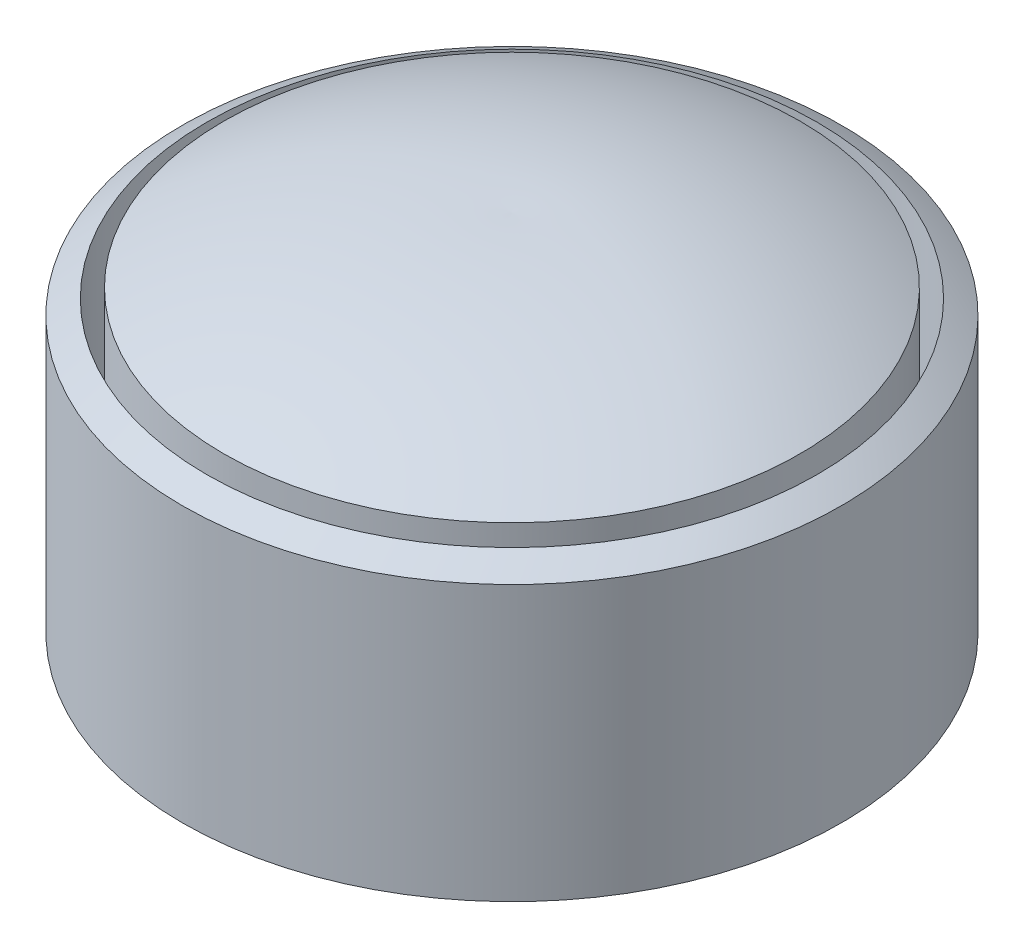
ISO-10303-21;
HEADER;
FILE_DESCRIPTION(('STEP AP214'),'2;1');
FILE_NAME('part.step','',(''),(''),'','','');
FILE_SCHEMA(('AUTOMOTIVE_DESIGN { 1 0 10303 214 1 1 1 1 }'));
ENDSEC;
DATA;
#1=APPLICATION_CONTEXT('core data for automotive mechanical design processes');
#2=APPLICATION_PROTOCOL_DEFINITION('international standard','automotive_design',2000,#1);
#3=PRODUCT_CONTEXT('',#1,'mechanical');
#4=PRODUCT('Part','Part','',(#3));
#5=PRODUCT_RELATED_PRODUCT_CATEGORY('part','',(#4));
#6=PRODUCT_DEFINITION_FORMATION('','',#4);
#7=PRODUCT_DEFINITION_CONTEXT('part definition',#1,'design');
#8=PRODUCT_DEFINITION('design','',#6,#7);
#9=PRODUCT_DEFINITION_SHAPE('','',#8);
#10=(LENGTH_UNIT() NAMED_UNIT(*) SI_UNIT(.MILLI.,.METRE.));
#11=(NAMED_UNIT(*) PLANE_ANGLE_UNIT() SI_UNIT($,.RADIAN.));
#12=(NAMED_UNIT(*) SI_UNIT($,.STERADIAN.) SOLID_ANGLE_UNIT());
#13=UNCERTAINTY_MEASURE_WITH_UNIT(LENGTH_MEASURE(1.E-05),#10,'distance_accuracy_value','');
#14=(GEOMETRIC_REPRESENTATION_CONTEXT(3) GLOBAL_UNCERTAINTY_ASSIGNED_CONTEXT((#13)) GLOBAL_UNIT_ASSIGNED_CONTEXT((#10,
#11,#12)) REPRESENTATION_CONTEXT('',''));
#15=CARTESIAN_POINT('',(0.,0.,0.));
#16=DIRECTION('',(0.,0.,1.));
#17=DIRECTION('',(1.,0.,0.));
#18=AXIS2_PLACEMENT_3D('',#15,#16,#17);
#19=CARTESIAN_POINT('',(0.,0.,0.));
#20=DIRECTION('',(0.,-1.,0.));
#21=DIRECTION('',(0.,0.,-1.));
#22=AXIS2_PLACEMENT_3D('',#19,#20,#21);
#23=PLANE('',#22);
#24=CARTESIAN_POINT('',(4.8,0.,0.));
#25=DIRECTION('',(0.,-1.,0.));
#26=DIRECTION('',(0.,0.,-1.));
#27=AXIS2_PLACEMENT_3D('',#24,#25,#26);
#28=CIRCLE('',#27,4.445360430483);
#29=CARTESIAN_POINT('',(4.8,0.,-4.445360430483));
#30=VERTEX_POINT('',#29);
#31=EDGE_CURVE('E11',#30,#30,#28,.T.);
#32=ORIENTED_EDGE('',*,*,#31,.F.);
#33=EDGE_LOOP('',(#32));
#34=FACE_BOUND('',#33,.T.);
#35=CARTESIAN_POINT('',(4.8,0.,0.));
#36=DIRECTION('',(0.,1.,0.));
#37=DIRECTION('',(0.,0.,1.));
#38=AXIS2_PLACEMENT_3D('',#35,#36,#37);
#39=CIRCLE('',#38,4.8);
#40=CARTESIAN_POINT('',(4.8,0.,4.8));
#41=VERTEX_POINT('',#40);
#42=EDGE_CURVE('E58',#41,#41,#39,.T.);
#43=ORIENTED_EDGE('',*,*,#42,.F.);
#44=EDGE_LOOP('',(#43));
#45=FACE_BOUND('',#44,.T.);
#46=ADVANCED_FACE('F45',(#34,#45),#23,.T.);
#47=CARTESIAN_POINT('',(4.8,5.3,0.));
#48=CARTESIAN_POINT('',(2.18413446245623,5.39755382525792,0.));
#49=CARTESIAN_POINT('',(0.,4.,0.));
#50=B_SPLINE_CURVE_WITH_KNOTS('',2,(#47,#48,#49),.UNSPECIFIED.,.F.,.F.,(3,3),(0.,1.),.UNSPECIFIED.);
#51=CARTESIAN_POINT('',(4.8,5.3,0.));
#52=DIRECTION('',(0.,1.,0.));
#53=AXIS1_PLACEMENT('',#51,#52);
#54=SURFACE_OF_REVOLUTION('',#50,#53);
#55=CARTESIAN_POINT('',(4.8,4.21543042185196,0.));
#56=DIRECTION('',(0.,1.,0.));
#57=DIRECTION('',(0.,0.,1.));
#58=AXIS2_PLACEMENT_3D('',#55,#56,#57);
#59=CIRCLE('',#58,4.445360430483);
#60=CARTESIAN_POINT('',(4.8,4.21543042185196,4.445360430483));
#61=VERTEX_POINT('',#60);
#62=EDGE_CURVE('E54',#61,#61,#59,.T.);
#63=ORIENTED_EDGE('',*,*,#62,.F.);
#64=EDGE_LOOP('',(#63));
#65=FACE_BOUND('',#64,.T.);
#66=CARTESIAN_POINT('',(4.8,4.,0.));
#67=DIRECTION('',(0.,1.,0.));
#68=DIRECTION('',(0.,0.,1.));
#69=AXIS2_PLACEMENT_3D('',#66,#67,#68);
#70=CIRCLE('',#69,4.8);
#71=CARTESIAN_POINT('',(4.8,4.,4.8));
#72=VERTEX_POINT('',#71);
#73=EDGE_CURVE('E63',#72,#72,#70,.T.);
#74=ORIENTED_EDGE('',*,*,#73,.T.);
#75=EDGE_LOOP('',(#74));
#76=FACE_BOUND('',#75,.T.);
#77=ADVANCED_FACE('F67',(#65,#76),#54,.F.);
#78=CARTESIAN_POINT('',(4.8,5.3,0.));
#79=DIRECTION('',(0.,1.,0.));
#80=DIRECTION('',(0.,0.,1.));
#81=AXIS2_PLACEMENT_3D('',#78,#79,#80);
#82=CYLINDRICAL_SURFACE('',#81,4.8);
#83=ORIENTED_EDGE('',*,*,#42,.T.);
#84=EDGE_LOOP('',(#83));
#85=FACE_BOUND('',#84,.T.);
#86=ORIENTED_EDGE('',*,*,#73,.F.);
#87=EDGE_LOOP('',(#86));
#88=FACE_BOUND('',#87,.T.);
#89=ADVANCED_FACE('F69',(#85,#88),#82,.T.);
#90=CARTESIAN_POINT('',(4.8,4.5,0.));
#91=DIRECTION('',(0.,-1.,0.));
#92=DIRECTION('',(0.,0.,-1.));
#93=AXIS2_PLACEMENT_3D('',#90,#91,#92);
#94=CYLINDRICAL_SURFACE('',#93,4.445360430483);
#95=ORIENTED_EDGE('',*,*,#62,.T.);
#96=EDGE_LOOP('',(#95));
#97=FACE_BOUND('',#96,.T.);
#98=ORIENTED_EDGE('',*,*,#31,.T.);
#99=EDGE_LOOP('',(#98));
#100=FACE_BOUND('',#99,.T.);
#101=ADVANCED_FACE('F71',(#97,#100),#94,.F.);
#102=CLOSED_SHELL('',(#46,#77,#89,#101));
#103=MANIFOLD_SOLID_BREP('B2',#102);
#104=CARTESIAN_POINT('',(4.8,5.3,0.));
#105=CARTESIAN_POINT('',(2.18413446245623,5.39755382525792,0.));
#106=CARTESIAN_POINT('',(0.,4.,0.));
#107=B_SPLINE_CURVE_WITH_KNOTS('',2,(#104,#105,#106),.UNSPECIFIED.,.F.,.F.,(3,3),(0.,1.),.UNSPECIFIED.);
#108=CARTESIAN_POINT('',(4.8,5.3,0.));
#109=DIRECTION('',(0.,1.,0.));
#110=AXIS1_PLACEMENT('',#108,#109);
#111=SURFACE_OF_REVOLUTION('',#107,#110);
#112=CARTESIAN_POINT('',(4.8,5.3,0.));
#113=VERTEX_POINT('',#112);
#114=VERTEX_LOOP('',#113);
#115=FACE_BOUND('',#114,.T.);
#116=CARTESIAN_POINT('',(4.8,4.35314684090633,0.));
#117=DIRECTION('',(0.,1.,0.));
#118=DIRECTION('',(0.,0.,1.));
#119=AXIS2_PLACEMENT_3D('',#116,#117,#118);
#120=CIRCLE('',#119,4.19667961097472);
#121=CARTESIAN_POINT('',(4.8,4.35314684090633,4.19667961097472));
#122=VERTEX_POINT('',#121);
#123=EDGE_CURVE('E43',#122,#122,#120,.T.);
#124=ORIENTED_EDGE('',*,*,#123,.T.);
#125=EDGE_LOOP('',(#124));
#126=FACE_BOUND('',#125,.T.);
#127=ADVANCED_FACE('F114',(#115,#126),#111,.F.);
#128=CARTESIAN_POINT('',(4.8,4.5,0.));
#129=DIRECTION('',(0.,-1.,0.));
#130=DIRECTION('',(0.,0.,-1.));
#131=AXIS2_PLACEMENT_3D('',#128,#129,#130);
#132=CYLINDRICAL_SURFACE('',#131,4.19667961097472);
#133=ORIENTED_EDGE('',*,*,#123,.F.);
#134=EDGE_LOOP('',(#133));
#135=FACE_BOUND('',#134,.T.);
#136=CARTESIAN_POINT('',(4.8,0.,0.));
#137=DIRECTION('',(0.,-1.,0.));
#138=DIRECTION('',(0.,0.,-1.));
#139=AXIS2_PLACEMENT_3D('',#136,#137,#138);
#140=CIRCLE('',#139,4.19667961097472);
#141=CARTESIAN_POINT('',(4.8,0.,-4.19667961097472));
#142=VERTEX_POINT('',#141);
#143=EDGE_CURVE('E121',#142,#142,#140,.T.);
#144=ORIENTED_EDGE('',*,*,#143,.F.);
#145=EDGE_LOOP('',(#144));
#146=FACE_BOUND('',#145,.T.);
#147=ADVANCED_FACE('F126',(#135,#146),#132,.T.);
#148=CARTESIAN_POINT('',(0.,0.,0.));
#149=DIRECTION('',(0.,-1.,0.));
#150=DIRECTION('',(0.,0.,-1.));
#151=AXIS2_PLACEMENT_3D('',#148,#149,#150);
#152=PLANE('',#151);
#153=ORIENTED_EDGE('',*,*,#143,.T.);
#154=EDGE_LOOP('',(#153));
#155=FACE_BOUND('',#154,.T.);
#156=ADVANCED_FACE('F116',(#155),#152,.T.);
#157=CLOSED_SHELL('',(#127,#147,#156));
#158=MANIFOLD_SOLID_BREP('B6',#157);
#159=ADVANCED_BREP_SHAPE_REPRESENTATION('',(#18,#103,#158),#14);
#160=SHAPE_DEFINITION_REPRESENTATION(#9,#159);
ENDSEC;
END-ISO-10303-21;
